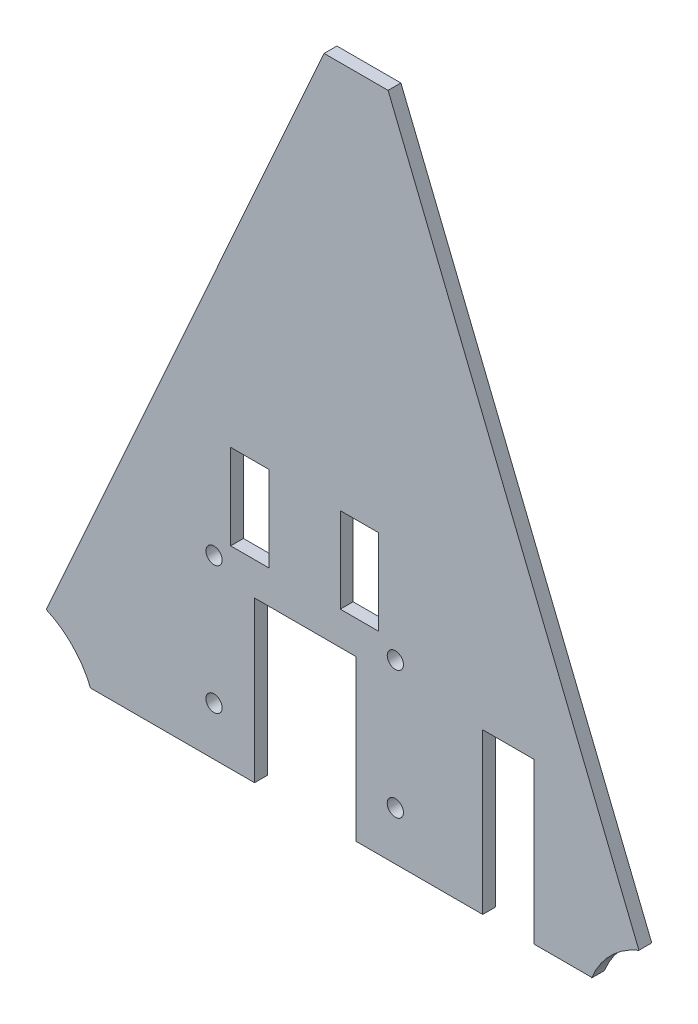
ISO-10303-21;
HEADER;
FILE_DESCRIPTION(('STEP AP214'),'2;1');
FILE_NAME('part.step','',(''),(''),'','','');
FILE_SCHEMA(('AUTOMOTIVE_DESIGN { 1 0 10303 214 1 1 1 1 }'));
ENDSEC;
DATA;
#1=APPLICATION_CONTEXT('core data for automotive mechanical design processes');
#2=APPLICATION_PROTOCOL_DEFINITION('international standard','automotive_design',2000,#1);
#3=PRODUCT_CONTEXT('',#1,'mechanical');
#4=PRODUCT('Part','Part','',(#3));
#5=PRODUCT_RELATED_PRODUCT_CATEGORY('part','',(#4));
#6=PRODUCT_DEFINITION_FORMATION('','',#4);
#7=PRODUCT_DEFINITION_CONTEXT('part definition',#1,'design');
#8=PRODUCT_DEFINITION('design','',#6,#7);
#9=PRODUCT_DEFINITION_SHAPE('','',#8);
#10=(LENGTH_UNIT() NAMED_UNIT(*) SI_UNIT(.MILLI.,.METRE.));
#11=(NAMED_UNIT(*) PLANE_ANGLE_UNIT() SI_UNIT($,.RADIAN.));
#12=(NAMED_UNIT(*) SI_UNIT($,.STERADIAN.) SOLID_ANGLE_UNIT());
#13=UNCERTAINTY_MEASURE_WITH_UNIT(LENGTH_MEASURE(1.E-05),#10,'distance_accuracy_value','');
#14=(GEOMETRIC_REPRESENTATION_CONTEXT(3) GLOBAL_UNCERTAINTY_ASSIGNED_CONTEXT((#13)) GLOBAL_UNIT_ASSIGNED_CONTEXT((#10,
#11,#12)) REPRESENTATION_CONTEXT('',''));
#15=CARTESIAN_POINT('',(0.,0.,0.));
#16=DIRECTION('',(0.,0.,1.));
#17=DIRECTION('',(1.,0.,0.));
#18=AXIS2_PLACEMENT_3D('',#15,#16,#17);
#19=CARTESIAN_POINT('',(0.,0.,0.));
#20=DIRECTION('',(0.,0.,1.));
#21=DIRECTION('',(1.,0.,0.));
#22=AXIS2_PLACEMENT_3D('',#19,#20,#21);
#23=PLANE('',#22);
#24=DIRECTION('',(-1.,0.,0.));
#25=VECTOR('',#24,1.);
#26=CARTESIAN_POINT('',(-157.234947473833,14.4657520615314,0.));
#27=LINE('',#26,#25);
#28=CARTESIAN_POINT('',(-157.234947473833,14.4657520615314,0.));
#29=VERTEX_POINT('',#28);
#30=CARTESIAN_POINT('',(-180.094947473833,14.4657520615314,0.));
#31=VERTEX_POINT('',#30);
#32=EDGE_CURVE('E418',#29,#31,#27,.T.);
#33=ORIENTED_EDGE('',*,*,#32,.T.);
#34=DIRECTION('',(0.,-1.,0.));
#35=VECTOR('',#34,1.);
#36=CARTESIAN_POINT('',(-180.094947473833,14.4657520615314,0.));
#37=LINE('',#36,#35);
#38=CARTESIAN_POINT('',(-180.094947473833,-36.3342479384686,0.));
#39=VERTEX_POINT('',#38);
#40=EDGE_CURVE('E415',#31,#39,#37,.T.);
#41=ORIENTED_EDGE('',*,*,#40,.T.);
#42=DIRECTION('',(-1.,0.,0.));
#43=VECTOR('',#42,1.);
#44=CARTESIAN_POINT('',(-157.234947473833,-36.3342479384686,0.));
#45=LINE('',#44,#43);
#46=CARTESIAN_POINT('',(-157.234947473833,-36.3342479384686,0.));
#47=VERTEX_POINT('',#46);
#48=EDGE_CURVE('E412',#47,#39,#45,.T.);
#49=ORIENTED_EDGE('',*,*,#48,.F.);
#50=DIRECTION('',(0.,-1.,0.));
#51=VECTOR('',#50,1.);
#52=CARTESIAN_POINT('',(-157.234947473833,14.4657520615314,0.));
#53=LINE('',#52,#51);
#54=EDGE_CURVE('E409',#29,#47,#53,.T.);
#55=ORIENTED_EDGE('',*,*,#54,.F.);
#56=EDGE_LOOP('',(#33,#41,#49,#55));
#57=FACE_BOUND('',#56,.T.);
#58=CARTESIAN_POINT('',(-255.278947473833,-46.2086142869327,0.));
#59=DIRECTION('',(0.,0.,-1.));
#60=DIRECTION('',(-1.,0.,0.));
#61=AXIS2_PLACEMENT_3D('',#58,#59,#60);
#62=CIRCLE('',#61,4.82599999999993);
#63=CARTESIAN_POINT('',(-260.104947473833,-46.2086142869327,0.));
#64=VERTEX_POINT('',#63);
#65=EDGE_CURVE('E227',#64,#64,#62,.T.);
#66=ORIENTED_EDGE('',*,*,#65,.F.);
#67=EDGE_LOOP('',(#66));
#68=FACE_BOUND('',#67,.T.);
#69=CARTESIAN_POINT('',(-147.328947473833,-46.2086142869327,0.));
#70=DIRECTION('',(0.,0.,-1.));
#71=DIRECTION('',(-1.,0.,0.));
#72=AXIS2_PLACEMENT_3D('',#69,#70,#71);
#73=CIRCLE('',#72,4.82599999999999);
#74=CARTESIAN_POINT('',(-152.154947473833,-46.2086142869327,0.));
#75=VERTEX_POINT('',#74);
#76=EDGE_CURVE('E432',#75,#75,#73,.T.);
#77=ORIENTED_EDGE('',*,*,#76,.F.);
#78=EDGE_LOOP('',(#77));
#79=FACE_BOUND('',#78,.T.);
#80=CARTESIAN_POINT('',(-147.328947473833,-122.408614286933,0.));
#81=DIRECTION('',(0.,0.,-1.));
#82=DIRECTION('',(-1.,0.,0.));
#83=AXIS2_PLACEMENT_3D('',#80,#81,#82);
#84=CIRCLE('',#83,4.82599999999999);
#85=CARTESIAN_POINT('',(-152.154947473833,-122.408614286933,0.));
#86=VERTEX_POINT('',#85);
#87=EDGE_CURVE('E261',#86,#86,#84,.T.);
#88=ORIENTED_EDGE('',*,*,#87,.F.);
#89=EDGE_LOOP('',(#88));
#90=FACE_BOUND('',#89,.T.);
#91=CARTESIAN_POINT('',(-255.278947473833,-122.408614286933,0.));
#92=DIRECTION('',(0.,0.,-1.));
#93=DIRECTION('',(-1.,0.,0.));
#94=AXIS2_PLACEMENT_3D('',#91,#92,#93);
#95=CIRCLE('',#94,4.82599999999993);
#96=CARTESIAN_POINT('',(-260.104947473833,-122.408614286933,0.));
#97=VERTEX_POINT('',#96);
#98=EDGE_CURVE('E267',#97,#97,#95,.T.);
#99=ORIENTED_EDGE('',*,*,#98,.F.);
#100=EDGE_LOOP('',(#99));
#101=FACE_BOUND('',#100,.T.);
#102=DIRECTION('',(-1.,0.,0.));
#103=VECTOR('',#102,1.);
#104=CARTESIAN_POINT('',(-222.512947473833,14.4657520615314,0.));
#105=LINE('',#104,#103);
#106=CARTESIAN_POINT('',(-222.512947473833,14.4657520615314,0.));
#107=VERTEX_POINT('',#106);
#108=CARTESIAN_POINT('',(-245.372947473833,14.4657520615314,0.));
#109=VERTEX_POINT('',#108);
#110=EDGE_CURVE('E376',#107,#109,#105,.T.);
#111=ORIENTED_EDGE('',*,*,#110,.T.);
#112=DIRECTION('',(0.,-1.,0.));
#113=VECTOR('',#112,1.);
#114=CARTESIAN_POINT('',(-245.372947473833,14.4657520615314,0.));
#115=LINE('',#114,#113);
#116=CARTESIAN_POINT('',(-245.372947473833,-36.3342479384686,0.));
#117=VERTEX_POINT('',#116);
#118=EDGE_CURVE('E379',#109,#117,#115,.T.);
#119=ORIENTED_EDGE('',*,*,#118,.T.);
#120=DIRECTION('',(-1.,0.,0.));
#121=VECTOR('',#120,1.);
#122=CARTESIAN_POINT('',(-222.512947473833,-36.3342479384686,0.));
#123=LINE('',#122,#121);
#124=CARTESIAN_POINT('',(-222.512947473833,-36.3342479384686,0.));
#125=VERTEX_POINT('',#124);
#126=EDGE_CURVE('E382',#125,#117,#123,.T.);
#127=ORIENTED_EDGE('',*,*,#126,.F.);
#128=DIRECTION('',(0.,-1.,0.));
#129=VECTOR('',#128,1.);
#130=CARTESIAN_POINT('',(-222.512947473833,14.4657520615314,0.));
#131=LINE('',#130,#129);
#132=EDGE_CURVE('E385',#107,#125,#131,.T.);
#133=ORIENTED_EDGE('',*,*,#132,.F.);
#134=EDGE_LOOP('',(#111,#119,#127,#133));
#135=FACE_BOUND('',#134,.T.);
#136=DIRECTION('',(-1.,0.,0.));
#137=VECTOR('',#136,1.);
#138=CARTESIAN_POINT('',(-218.448947473833,-56.1146142869327,0.));
#139=LINE('',#138,#137);
#140=CARTESIAN_POINT('',(-170.823947473833,-56.1146142869327,0.));
#141=VERTEX_POINT('',#140);
#142=CARTESIAN_POINT('',(-231.148947473833,-56.1146142869327,0.));
#143=VERTEX_POINT('',#142);
#144=EDGE_CURVE('E205',#141,#143,#139,.T.);
#145=ORIENTED_EDGE('',*,*,#144,.T.);
#146=DIRECTION('',(0.,1.,0.));
#147=VECTOR('',#146,1.);
#148=CARTESIAN_POINT('',(-231.148947473833,-151.364614286933,0.));
#149=LINE('',#148,#147);
#150=CARTESIAN_POINT('',(-231.148947473833,-151.364614286933,0.));
#151=VERTEX_POINT('',#150);
#152=EDGE_CURVE('E195',#151,#143,#149,.T.);
#153=ORIENTED_EDGE('',*,*,#152,.F.);
#154=DIRECTION('',(-1.,0.,0.));
#155=VECTOR('',#154,1.);
#156=CARTESIAN_POINT('',(-30.4451147456604,-151.364614286933,0.));
#157=LINE('',#156,#155);
#158=CARTESIAN_POINT('',(-328.815664837269,-151.364614286933,0.));
#159=VERTEX_POINT('',#158);
#160=EDGE_CURVE('E203',#151,#159,#157,.T.);
#161=ORIENTED_EDGE('',*,*,#160,.T.);
#162=CARTESIAN_POINT('',(-375.908525230326,-170.414614286933,0.));
#163=DIRECTION('',(0.,0.,-1.));
#164=DIRECTION('',(-1.,0.,0.));
#165=AXIS2_PLACEMENT_3D('',#162,#163,#164);
#166=CIRCLE('',#165,50.8);
#167=CARTESIAN_POINT('',(-355.149261179153,-124.049832867695,0.));
#168=VERTEX_POINT('',#167);
#169=EDGE_CURVE('E234',#168,#159,#166,.T.);
#170=ORIENTED_EDGE('',*,*,#169,.F.);
#171=DIRECTION('',(-0.408646930141206,-0.912692547622785,0.));
#172=VECTOR('',#171,1.);
#173=CARTESIAN_POINT('',(-189.740054038778,245.383385713067,0.));
#174=LINE('',#173,#172);
#175=CARTESIAN_POINT('',(-189.740054038778,245.383385713067,0.));
#176=VERTEX_POINT('',#175);
#177=EDGE_CURVE('E280',#176,#168,#174,.T.);
#178=ORIENTED_EDGE('',*,*,#177,.F.);
#179=DIRECTION('',(1.,0.,0.));
#180=VECTOR('',#179,1.);
#181=CARTESIAN_POINT('',(-189.740054038778,245.383385713067,0.));
#182=LINE('',#181,#180);
#183=CARTESIAN_POINT('',(-151.640054038778,245.383385713067,0.));
#184=VERTEX_POINT('',#183);
#185=EDGE_CURVE('E274',#176,#184,#182,.T.);
#186=ORIENTED_EDGE('',*,*,#185,.T.);
#187=DIRECTION('',(-0.375415571225287,0.926856595640119,0.));
#188=VECTOR('',#187,1.);
#189=CARTESIAN_POINT('',(16.7754747696738,-170.414614286933,0.));
#190=LINE('',#189,#188);
#191=CARTESIAN_POINT('',(-2.29563624857079,-123.330299228415,0.));
#192=VERTEX_POINT('',#191);
#193=EDGE_CURVE('E288',#192,#184,#190,.T.);
#194=ORIENTED_EDGE('',*,*,#193,.F.);
#195=CARTESIAN_POINT('',(16.7754747696738,-170.414614286933,0.));
#196=DIRECTION('',(0.,0.,-1.));
#197=DIRECTION('',(-1.,0.,0.));
#198=AXIS2_PLACEMENT_3D('',#195,#196,#197);
#199=CIRCLE('',#198,50.8);
#200=CARTESIAN_POINT('',(-30.4451147456604,-151.68346574168,0.));
#201=VERTEX_POINT('',#200);
#202=EDGE_CURVE('E243',#201,#192,#199,.T.);
#203=ORIENTED_EDGE('',*,*,#202,.F.);
#204=DIRECTION('',(0.,1.,0.));
#205=VECTOR('',#204,1.);
#206=CARTESIAN_POINT('',(-30.4451147456604,-170.414614286933,0.));
#207=LINE('',#206,#205);
#208=CARTESIAN_POINT('',(-30.4451147456604,-151.364614286933,0.));
#209=VERTEX_POINT('',#208);
#210=EDGE_CURVE('E324',#201,#209,#207,.T.);
#211=ORIENTED_EDGE('',*,*,#210,.T.);
#212=DIRECTION('',(-1.,0.,0.));
#213=VECTOR('',#212,1.);
#214=CARTESIAN_POINT('',(-30.4451147456604,-151.364614286933,0.));
#215=LINE('',#214,#213);
#216=CARTESIAN_POINT('',(-64.8262570465055,-151.364614286933,0.));
#217=VERTEX_POINT('',#216);
#218=EDGE_CURVE('E327',#209,#217,#215,.T.);
#219=ORIENTED_EDGE('',*,*,#218,.T.);
#220=DIRECTION('',(0.,1.,0.));
#221=VECTOR('',#220,1.);
#222=CARTESIAN_POINT('',(-64.8262570465055,-170.414614286933,0.));
#223=LINE('',#222,#221);
#224=CARTESIAN_POINT('',(-64.8262570465055,-56.1146142869327,0.));
#225=VERTEX_POINT('',#224);
#226=EDGE_CURVE('E247',#217,#225,#223,.T.);
#227=ORIENTED_EDGE('',*,*,#226,.T.);
#228=DIRECTION('',(-1.,0.,0.));
#229=VECTOR('',#228,1.);
#230=CARTESIAN_POINT('',(-64.8262570465055,-56.1146142869327,0.));
#231=LINE('',#230,#229);
#232=CARTESIAN_POINT('',(-95.3062570465055,-56.1146142869327,0.));
#233=VERTEX_POINT('',#232);
#234=EDGE_CURVE('E249',#225,#233,#231,.T.);
#235=ORIENTED_EDGE('',*,*,#234,.T.);
#236=DIRECTION('',(0.,-1.,0.));
#237=VECTOR('',#236,1.);
#238=CARTESIAN_POINT('',(-95.3062570465055,-56.1146142869327,0.));
#239=LINE('',#238,#237);
#240=CARTESIAN_POINT('',(-95.3062570465055,-151.364614286933,0.));
#241=VERTEX_POINT('',#240);
#242=EDGE_CURVE('E252',#233,#241,#239,.T.);
#243=ORIENTED_EDGE('',*,*,#242,.T.);
#244=DIRECTION('',(-1.,0.,0.));
#245=VECTOR('',#244,1.);
#246=CARTESIAN_POINT('',(-30.4451147456604,-151.364614286933,0.));
#247=LINE('',#246,#245);
#248=CARTESIAN_POINT('',(-170.823947473833,-151.364614286933,0.));
#249=VERTEX_POINT('',#248);
#250=EDGE_CURVE('E223',#241,#249,#247,.T.);
#251=ORIENTED_EDGE('',*,*,#250,.T.);
#252=DIRECTION('',(0.,1.,0.));
#253=VECTOR('',#252,1.);
#254=CARTESIAN_POINT('',(-170.823947473833,-151.364614286933,0.));
#255=LINE('',#254,#253);
#256=EDGE_CURVE('E60',#249,#141,#255,.T.);
#257=ORIENTED_EDGE('',*,*,#256,.T.);
#258=EDGE_LOOP('',(#145,#153,#161,#170,#178,#186,#194,#203,#211,#219,#227,#235,#243,#251,#257));
#259=FACE_BOUND('',#258,.T.);
#260=ADVANCED_FACE('F37',(#57,#68,#79,#90,#101,#135,#259),#23,.F.);
#261=CARTESIAN_POINT('',(0.,0.,7.62));
#262=DIRECTION('',(0.,0.,1.));
#263=DIRECTION('',(1.,0.,0.));
#264=AXIS2_PLACEMENT_3D('',#261,#262,#263);
#265=PLANE('',#264);
#266=CARTESIAN_POINT('',(-255.278947473833,-46.2086142869327,7.62));
#267=DIRECTION('',(0.,0.,1.));
#268=DIRECTION('',(1.,0.,0.));
#269=AXIS2_PLACEMENT_3D('',#266,#267,#268);
#270=CIRCLE('',#269,4.82599999999993);
#271=CARTESIAN_POINT('',(-250.452947473833,-46.2086142869327,7.62));
#272=VERTEX_POINT('',#271);
#273=EDGE_CURVE('E429',#272,#272,#270,.F.);
#274=ORIENTED_EDGE('',*,*,#273,.T.);
#275=EDGE_LOOP('',(#274));
#276=FACE_BOUND('',#275,.T.);
#277=CARTESIAN_POINT('',(-147.328947473833,-46.2086142869327,7.62));
#278=DIRECTION('',(0.,0.,1.));
#279=DIRECTION('',(1.,0.,0.));
#280=AXIS2_PLACEMENT_3D('',#277,#278,#279);
#281=CIRCLE('',#280,4.82599999999999);
#282=CARTESIAN_POINT('',(-142.502947473833,-46.2086142869327,7.62));
#283=VERTEX_POINT('',#282);
#284=EDGE_CURVE('E399',#283,#283,#281,.F.);
#285=ORIENTED_EDGE('',*,*,#284,.T.);
#286=EDGE_LOOP('',(#285));
#287=FACE_BOUND('',#286,.T.);
#288=CARTESIAN_POINT('',(-147.328947473833,-122.408614286933,7.62));
#289=DIRECTION('',(0.,0.,1.));
#290=DIRECTION('',(1.,0.,0.));
#291=AXIS2_PLACEMENT_3D('',#288,#289,#290);
#292=CIRCLE('',#291,4.82599999999999);
#293=CARTESIAN_POINT('',(-142.502947473833,-122.408614286933,7.62));
#294=VERTEX_POINT('',#293);
#295=EDGE_CURVE('E264',#294,#294,#292,.F.);
#296=ORIENTED_EDGE('',*,*,#295,.T.);
#297=EDGE_LOOP('',(#296));
#298=FACE_BOUND('',#297,.T.);
#299=CARTESIAN_POINT('',(-255.278947473833,-122.408614286933,7.62));
#300=DIRECTION('',(0.,0.,1.));
#301=DIRECTION('',(1.,0.,0.));
#302=AXIS2_PLACEMENT_3D('',#299,#300,#301);
#303=CIRCLE('',#302,4.82599999999993);
#304=CARTESIAN_POINT('',(-250.452947473833,-122.408614286933,7.62));
#305=VERTEX_POINT('',#304);
#306=EDGE_CURVE('E260',#305,#305,#303,.F.);
#307=ORIENTED_EDGE('',*,*,#306,.T.);
#308=EDGE_LOOP('',(#307));
#309=FACE_BOUND('',#308,.T.);
#310=DIRECTION('',(0.,-1.,0.));
#311=VECTOR('',#310,1.);
#312=CARTESIAN_POINT('',(-180.094947473833,14.4657520615314,7.62));
#313=LINE('',#312,#311);
#314=CARTESIAN_POINT('',(-180.094947473833,14.4657520615314,7.62));
#315=VERTEX_POINT('',#314);
#316=CARTESIAN_POINT('',(-180.094947473833,-36.3342479384686,7.62));
#317=VERTEX_POINT('',#316);
#318=EDGE_CURVE('E423',#315,#317,#313,.T.);
#319=ORIENTED_EDGE('',*,*,#318,.F.);
#320=DIRECTION('',(-1.,0.,0.));
#321=VECTOR('',#320,1.);
#322=CARTESIAN_POINT('',(-157.234947473833,14.4657520615314,7.62));
#323=LINE('',#322,#321);
#324=CARTESIAN_POINT('',(-157.234947473833,14.4657520615314,7.62));
#325=VERTEX_POINT('',#324);
#326=EDGE_CURVE('E421',#325,#315,#323,.T.);
#327=ORIENTED_EDGE('',*,*,#326,.F.);
#328=DIRECTION('',(0.,-1.,0.));
#329=VECTOR('',#328,1.);
#330=CARTESIAN_POINT('',(-157.234947473833,14.4657520615314,7.62));
#331=LINE('',#330,#329);
#332=CARTESIAN_POINT('',(-157.234947473833,-36.3342479384686,7.62));
#333=VERTEX_POINT('',#332);
#334=EDGE_CURVE('E355',#325,#333,#331,.T.);
#335=ORIENTED_EDGE('',*,*,#334,.T.);
#336=DIRECTION('',(-1.,0.,0.));
#337=VECTOR('',#336,1.);
#338=CARTESIAN_POINT('',(-157.234947473833,-36.3342479384686,7.62));
#339=LINE('',#338,#337);
#340=EDGE_CURVE('E372',#333,#317,#339,.T.);
#341=ORIENTED_EDGE('',*,*,#340,.T.);
#342=EDGE_LOOP('',(#319,#327,#335,#341));
#343=FACE_BOUND('',#342,.T.);
#344=DIRECTION('',(0.,-1.,0.));
#345=VECTOR('',#344,1.);
#346=CARTESIAN_POINT('',(-245.372947473833,14.4657520615314,7.62));
#347=LINE('',#346,#345);
#348=CARTESIAN_POINT('',(-245.372947473833,14.4657520615314,7.62));
#349=VERTEX_POINT('',#348);
#350=CARTESIAN_POINT('',(-245.372947473833,-36.3342479384686,7.62));
#351=VERTEX_POINT('',#350);
#352=EDGE_CURVE('E371',#349,#351,#347,.T.);
#353=ORIENTED_EDGE('',*,*,#352,.F.);
#354=DIRECTION('',(-1.,0.,0.));
#355=VECTOR('',#354,1.);
#356=CARTESIAN_POINT('',(-222.512947473833,14.4657520615314,7.62));
#357=LINE('',#356,#355);
#358=CARTESIAN_POINT('',(-222.512947473833,14.4657520615314,7.62));
#359=VERTEX_POINT('',#358);
#360=EDGE_CURVE('E374',#359,#349,#357,.T.);
#361=ORIENTED_EDGE('',*,*,#360,.F.);
#362=DIRECTION('',(0.,-1.,0.));
#363=VECTOR('',#362,1.);
#364=CARTESIAN_POINT('',(-222.512947473833,14.4657520615314,7.62));
#365=LINE('',#364,#363);
#366=CARTESIAN_POINT('',(-222.512947473833,-36.3342479384686,7.62));
#367=VERTEX_POINT('',#366);
#368=EDGE_CURVE('E397',#359,#367,#365,.T.);
#369=ORIENTED_EDGE('',*,*,#368,.T.);
#370=DIRECTION('',(-1.,0.,0.));
#371=VECTOR('',#370,1.);
#372=CARTESIAN_POINT('',(-222.512947473833,-36.3342479384686,7.62));
#373=LINE('',#372,#371);
#374=EDGE_CURVE('E368',#367,#351,#373,.T.);
#375=ORIENTED_EDGE('',*,*,#374,.T.);
#376=EDGE_LOOP('',(#353,#361,#369,#375));
#377=FACE_BOUND('',#376,.T.);
#378=DIRECTION('',(0.,1.,0.));
#379=VECTOR('',#378,1.);
#380=CARTESIAN_POINT('',(-231.148947473833,-151.364614286933,7.62));
#381=LINE('',#380,#379);
#382=CARTESIAN_POINT('',(-231.148947473833,-151.364614286933,7.62));
#383=VERTEX_POINT('',#382);
#384=CARTESIAN_POINT('',(-231.148947473833,-56.1146142869327,7.62));
#385=VERTEX_POINT('',#384);
#386=EDGE_CURVE('E52',#383,#385,#381,.T.);
#387=ORIENTED_EDGE('',*,*,#386,.T.);
#388=DIRECTION('',(-1.,0.,0.));
#389=VECTOR('',#388,1.);
#390=CARTESIAN_POINT('',(-218.448947473833,-56.1146142869327,7.61999999999996));
#391=LINE('',#390,#389);
#392=CARTESIAN_POINT('',(-170.823947473833,-56.1146142869327,7.62));
#393=VERTEX_POINT('',#392);
#394=EDGE_CURVE('E272',#393,#385,#391,.T.);
#395=ORIENTED_EDGE('',*,*,#394,.F.);
#396=DIRECTION('',(0.,1.,0.));
#397=VECTOR('',#396,1.);
#398=CARTESIAN_POINT('',(-170.823947473833,-151.364614286933,7.62));
#399=LINE('',#398,#397);
#400=CARTESIAN_POINT('',(-170.823947473833,-151.364614286933,7.62));
#401=VERTEX_POINT('',#400);
#402=EDGE_CURVE('E207',#401,#393,#399,.T.);
#403=ORIENTED_EDGE('',*,*,#402,.F.);
#404=DIRECTION('',(-1.,0.,0.));
#405=VECTOR('',#404,1.);
#406=CARTESIAN_POINT('',(-30.4451147456604,-151.364614286933,7.62));
#407=LINE('',#406,#405);
#408=CARTESIAN_POINT('',(-95.3062570465055,-151.364614286933,7.62));
#409=VERTEX_POINT('',#408);
#410=EDGE_CURVE('E228',#409,#401,#407,.T.);
#411=ORIENTED_EDGE('',*,*,#410,.F.);
#412=DIRECTION('',(0.,1.,0.));
#413=VECTOR('',#412,1.);
#414=CARTESIAN_POINT('',(-95.3062570465055,0.,7.62));
#415=LINE('',#414,#413);
#416=CARTESIAN_POINT('',(-95.3062570465055,-56.1146142869327,7.62));
#417=VERTEX_POINT('',#416);
#418=EDGE_CURVE('E294',#409,#417,#415,.T.);
#419=ORIENTED_EDGE('',*,*,#418,.T.);
#420=DIRECTION('',(1.,0.,0.));
#421=VECTOR('',#420,1.);
#422=CARTESIAN_POINT('',(0.,-56.1146142869327,7.62));
#423=LINE('',#422,#421);
#424=CARTESIAN_POINT('',(-64.8262570465055,-56.1146142869327,7.62));
#425=VERTEX_POINT('',#424);
#426=EDGE_CURVE('E45',#417,#425,#423,.T.);
#427=ORIENTED_EDGE('',*,*,#426,.T.);
#428=DIRECTION('',(0.,-1.,0.));
#429=VECTOR('',#428,1.);
#430=CARTESIAN_POINT('',(-64.8262570465055,0.,7.62));
#431=LINE('',#430,#429);
#432=CARTESIAN_POINT('',(-64.8262570465055,-151.364614286933,7.62));
#433=VERTEX_POINT('',#432);
#434=EDGE_CURVE('E11',#425,#433,#431,.T.);
#435=ORIENTED_EDGE('',*,*,#434,.T.);
#436=DIRECTION('',(-1.,0.,0.));
#437=VECTOR('',#436,1.);
#438=CARTESIAN_POINT('',(-30.4451147456604,-151.364614286933,7.62));
#439=LINE('',#438,#437);
#440=CARTESIAN_POINT('',(-30.4451147456604,-151.364614286933,7.62));
#441=VERTEX_POINT('',#440);
#442=EDGE_CURVE('E317',#441,#433,#439,.T.);
#443=ORIENTED_EDGE('',*,*,#442,.F.);
#444=DIRECTION('',(0.,1.,0.));
#445=VECTOR('',#444,1.);
#446=CARTESIAN_POINT('',(-30.4451147456604,-170.414614286933,7.62));
#447=LINE('',#446,#445);
#448=CARTESIAN_POINT('',(-30.4451147456604,-151.68346574168,7.62));
#449=VERTEX_POINT('',#448);
#450=EDGE_CURVE('E319',#449,#441,#447,.T.);
#451=ORIENTED_EDGE('',*,*,#450,.F.);
#452=CARTESIAN_POINT('',(16.7754747696738,-170.414614286933,7.62));
#453=DIRECTION('',(0.,0.,1.));
#454=DIRECTION('',(1.,0.,0.));
#455=AXIS2_PLACEMENT_3D('',#452,#453,#454);
#456=CIRCLE('',#455,50.8);
#457=CARTESIAN_POINT('',(-2.29563624857079,-123.330299228415,7.62));
#458=VERTEX_POINT('',#457);
#459=EDGE_CURVE('E245',#449,#458,#456,.F.);
#460=ORIENTED_EDGE('',*,*,#459,.T.);
#461=DIRECTION('',(-0.375415571225287,0.926856595640119,0.));
#462=VECTOR('',#461,1.);
#463=CARTESIAN_POINT('',(16.7754747696738,-170.414614286933,7.62));
#464=LINE('',#463,#462);
#465=CARTESIAN_POINT('',(-151.640054038778,245.383385713067,7.62));
#466=VERTEX_POINT('',#465);
#467=EDGE_CURVE('E279',#458,#466,#464,.T.);
#468=ORIENTED_EDGE('',*,*,#467,.T.);
#469=DIRECTION('',(1.,0.,0.));
#470=VECTOR('',#469,1.);
#471=CARTESIAN_POINT('',(-189.740054038778,245.383385713067,7.62));
#472=LINE('',#471,#470);
#473=CARTESIAN_POINT('',(-189.740054038778,245.383385713067,7.62));
#474=VERTEX_POINT('',#473);
#475=EDGE_CURVE('E276',#474,#466,#472,.T.);
#476=ORIENTED_EDGE('',*,*,#475,.F.);
#477=DIRECTION('',(-0.408646930141206,-0.912692547622785,0.));
#478=VECTOR('',#477,1.);
#479=CARTESIAN_POINT('',(-189.740054038778,245.383385713067,7.62));
#480=LINE('',#479,#478);
#481=CARTESIAN_POINT('',(-355.149261179153,-124.049832867695,7.62));
#482=VERTEX_POINT('',#481);
#483=EDGE_CURVE('E282',#474,#482,#480,.T.);
#484=ORIENTED_EDGE('',*,*,#483,.T.);
#485=CARTESIAN_POINT('',(-375.908525230326,-170.414614286933,7.62));
#486=DIRECTION('',(0.,0.,1.));
#487=DIRECTION('',(1.,0.,0.));
#488=AXIS2_PLACEMENT_3D('',#485,#486,#487);
#489=CIRCLE('',#488,50.8);
#490=CARTESIAN_POINT('',(-328.815664837269,-151.364614286933,7.62));
#491=VERTEX_POINT('',#490);
#492=EDGE_CURVE('E237',#482,#491,#489,.F.);
#493=ORIENTED_EDGE('',*,*,#492,.T.);
#494=DIRECTION('',(-1.,0.,0.));
#495=VECTOR('',#494,1.);
#496=CARTESIAN_POINT('',(-30.4451147456604,-151.364614286933,7.62));
#497=LINE('',#496,#495);
#498=EDGE_CURVE('E218',#383,#491,#497,.T.);
#499=ORIENTED_EDGE('',*,*,#498,.F.);
#500=EDGE_LOOP('',(#387,#395,#403,#411,#419,#427,#435,#443,#451,#460,#468,#476,#484,#493,#499));
#501=FACE_BOUND('',#500,.T.);
#502=ADVANCED_FACE('F300',(#276,#287,#298,#309,#343,#377,#501),#265,.T.);
#503=CARTESIAN_POINT('',(-30.4451147456604,-151.364614286933,7.621));
#504=DIRECTION('',(0.,-1.,0.));
#505=DIRECTION('',(0.,0.,-1.));
#506=AXIS2_PLACEMENT_3D('',#503,#504,#505);
#507=PLANE('',#506);
#508=ORIENTED_EDGE('',*,*,#410,.T.);
#509=DIRECTION('',(0.,0.,-1.));
#510=VECTOR('',#509,1.);
#511=CARTESIAN_POINT('',(-170.823947473833,-151.364614286933,7.621));
#512=LINE('',#511,#510);
#513=EDGE_CURVE('E362',#401,#249,#512,.T.);
#514=ORIENTED_EDGE('',*,*,#513,.T.);
#515=ORIENTED_EDGE('',*,*,#250,.F.);
#516=DIRECTION('',(0.,0.,1.));
#517=VECTOR('',#516,1.);
#518=CARTESIAN_POINT('',(-95.3062570465055,-151.364614286933,7.621));
#519=LINE('',#518,#517);
#520=EDGE_CURVE('E226',#241,#409,#519,.T.);
#521=ORIENTED_EDGE('',*,*,#520,.T.);
#522=EDGE_LOOP('',(#508,#514,#515,#521));
#523=FACE_BOUND('',#522,.T.);
#524=ADVANCED_FACE('F510',(#523),#507,.T.);
#525=CARTESIAN_POINT('',(-64.8262570465055,-170.414614286933,25.4));
#526=DIRECTION('',(-1.,0.,0.));
#527=DIRECTION('',(0.,-1.,0.));
#528=AXIS2_PLACEMENT_3D('',#525,#526,#527);
#529=PLANE('',#528);
#530=ORIENTED_EDGE('',*,*,#226,.F.);
#531=DIRECTION('',(0.,0.,-1.));
#532=VECTOR('',#531,1.);
#533=CARTESIAN_POINT('',(-64.8262570465055,-151.364614286933,7.621));
#534=LINE('',#533,#532);
#535=EDGE_CURVE('E216',#433,#217,#534,.T.);
#536=ORIENTED_EDGE('',*,*,#535,.F.);
#537=ORIENTED_EDGE('',*,*,#434,.F.);
#538=DIRECTION('',(0.,0.,-1.));
#539=VECTOR('',#538,1.);
#540=CARTESIAN_POINT('',(-64.8262570465055,-56.1146142869327,25.4));
#541=LINE('',#540,#539);
#542=EDGE_CURVE('E257',#425,#225,#541,.T.);
#543=ORIENTED_EDGE('',*,*,#542,.T.);
#544=EDGE_LOOP('',(#530,#536,#537,#543));
#545=FACE_BOUND('',#544,.T.);
#546=ADVANCED_FACE('F312',(#545),#529,.T.);
#547=CARTESIAN_POINT('',(-95.3062570465055,-56.1146142869327,25.4));
#548=DIRECTION('',(1.,0.,0.));
#549=DIRECTION('',(0.,0.,-1.));
#550=AXIS2_PLACEMENT_3D('',#547,#548,#549);
#551=PLANE('',#550);
#552=ORIENTED_EDGE('',*,*,#418,.F.);
#553=ORIENTED_EDGE('',*,*,#520,.F.);
#554=ORIENTED_EDGE('',*,*,#242,.F.);
#555=DIRECTION('',(0.,0.,-1.));
#556=VECTOR('',#555,1.);
#557=CARTESIAN_POINT('',(-95.3062570465055,-56.1146142869327,25.4));
#558=LINE('',#557,#556);
#559=EDGE_CURVE('E255',#417,#233,#558,.T.);
#560=ORIENTED_EDGE('',*,*,#559,.F.);
#561=EDGE_LOOP('',(#552,#553,#554,#560));
#562=FACE_BOUND('',#561,.T.);
#563=ADVANCED_FACE('F518',(#562),#551,.T.);
#564=CARTESIAN_POINT('',(16.7754747696738,-170.414614286933,7.621));
#565=DIRECTION('',(0.,0.,-1.));
#566=DIRECTION('',(-1.,0.,0.));
#567=AXIS2_PLACEMENT_3D('',#564,#565,#566);
#568=CYLINDRICAL_SURFACE('',#567,50.8);
#569=DIRECTION('',(0.,0.,-1.));
#570=VECTOR('',#569,1.);
#571=CARTESIAN_POINT('',(-30.4451147456604,-151.68346574168,7.621));
#572=LINE('',#571,#570);
#573=EDGE_CURVE('E213',#449,#201,#572,.T.);
#574=ORIENTED_EDGE('',*,*,#573,.T.);
#575=ORIENTED_EDGE('',*,*,#202,.T.);
#576=DIRECTION('',(0.,0.,-1.));
#577=VECTOR('',#576,1.);
#578=CARTESIAN_POINT('',(-2.29563624857079,-123.330299228415,7.621));
#579=LINE('',#578,#577);
#580=EDGE_CURVE('E240',#192,#458,#579,.F.);
#581=ORIENTED_EDGE('',*,*,#580,.T.);
#582=ORIENTED_EDGE('',*,*,#459,.F.);
#583=EDGE_LOOP('',(#574,#575,#581,#582));
#584=FACE_BOUND('',#583,.T.);
#585=ADVANCED_FACE('F337',(#584),#568,.F.);
#586=CARTESIAN_POINT('',(-375.908525230326,-170.414614286933,7.621));
#587=DIRECTION('',(0.,0.,-1.));
#588=DIRECTION('',(-1.,0.,0.));
#589=AXIS2_PLACEMENT_3D('',#586,#587,#588);
#590=CYLINDRICAL_SURFACE('',#589,50.8);
#591=DIRECTION('',(0.,0.,-1.));
#592=VECTOR('',#591,1.);
#593=CARTESIAN_POINT('',(-328.815664837269,-151.364614286933,7.621));
#594=LINE('',#593,#592);
#595=EDGE_CURVE('E211',#159,#491,#594,.F.);
#596=ORIENTED_EDGE('',*,*,#595,.T.);
#597=ORIENTED_EDGE('',*,*,#492,.F.);
#598=DIRECTION('',(0.,0.,-1.));
#599=VECTOR('',#598,1.);
#600=CARTESIAN_POINT('',(-355.149261179153,-124.049832867695,7.621));
#601=LINE('',#600,#599);
#602=EDGE_CURVE('E232',#482,#168,#601,.T.);
#603=ORIENTED_EDGE('',*,*,#602,.T.);
#604=ORIENTED_EDGE('',*,*,#169,.T.);
#605=EDGE_LOOP('',(#596,#597,#603,#604));
#606=FACE_BOUND('',#605,.T.);
#607=ADVANCED_FACE('F352',(#606),#590,.F.);
#608=CARTESIAN_POINT('',(-189.740054038778,245.383385713067,7.62));
#609=DIRECTION('',(0.,1.,0.));
#610=DIRECTION('',(0.,0.,1.));
#611=AXIS2_PLACEMENT_3D('',#608,#609,#610);
#612=PLANE('',#611);
#613=ORIENTED_EDGE('',*,*,#185,.F.);
#614=DIRECTION('',(0.,0.,-1.));
#615=VECTOR('',#614,1.);
#616=CARTESIAN_POINT('',(-189.740054038778,245.383385713067,7.62));
#617=LINE('',#616,#615);
#618=EDGE_CURVE('E292',#474,#176,#617,.T.);
#619=ORIENTED_EDGE('',*,*,#618,.F.);
#620=ORIENTED_EDGE('',*,*,#475,.T.);
#621=DIRECTION('',(0.,0.,-1.));
#622=VECTOR('',#621,1.);
#623=CARTESIAN_POINT('',(-151.640054038778,245.383385713067,7.62));
#624=LINE('',#623,#622);
#625=EDGE_CURVE('E285',#466,#184,#624,.T.);
#626=ORIENTED_EDGE('',*,*,#625,.T.);
#627=EDGE_LOOP('',(#613,#619,#620,#626));
#628=FACE_BOUND('',#627,.T.);
#629=ADVANCED_FACE('F39',(#628),#612,.T.);
#630=CARTESIAN_POINT('',(-189.740054038778,245.383385713067,7.62));
#631=DIRECTION('',(0.912692547622784,-0.408646930141206,0.));
#632=DIRECTION('',(0.408646930141206,0.912692547622785,0.));
#633=AXIS2_PLACEMENT_3D('',#630,#631,#632);
#634=PLANE('',#633);
#635=ORIENTED_EDGE('',*,*,#177,.T.);
#636=ORIENTED_EDGE('',*,*,#602,.F.);
#637=ORIENTED_EDGE('',*,*,#483,.F.);
#638=ORIENTED_EDGE('',*,*,#618,.T.);
#639=EDGE_LOOP('',(#635,#636,#637,#638));
#640=FACE_BOUND('',#639,.T.);
#641=ADVANCED_FACE('F350',(#640),#634,.F.);
#642=CARTESIAN_POINT('',(16.7754747696738,-170.414614286933,7.62));
#643=DIRECTION('',(-0.926856595640119,-0.375415571225287,0.));
#644=DIRECTION('',(0.375415571225287,-0.926856595640119,0.));
#645=AXIS2_PLACEMENT_3D('',#642,#643,#644);
#646=PLANE('',#645);
#647=ORIENTED_EDGE('',*,*,#467,.F.);
#648=ORIENTED_EDGE('',*,*,#580,.F.);
#649=ORIENTED_EDGE('',*,*,#193,.T.);
#650=ORIENTED_EDGE('',*,*,#625,.F.);
#651=EDGE_LOOP('',(#647,#648,#649,#650));
#652=FACE_BOUND('',#651,.T.);
#653=ADVANCED_FACE('F341',(#652),#646,.F.);
#654=CARTESIAN_POINT('',(-218.448947473833,-56.1146142869327,-704.368315515871));
#655=DIRECTION('',(0.,-1.,0.));
#656=DIRECTION('',(0.,0.,-1.));
#657=AXIS2_PLACEMENT_3D('',#654,#655,#656);
#658=PLANE('',#657);
#659=ORIENTED_EDGE('',*,*,#144,.F.);
#660=DIRECTION('',(0.,0.,-1.));
#661=VECTOR('',#660,1.);
#662=CARTESIAN_POINT('',(-170.823947473833,-56.1146142869327,7.621));
#663=LINE('',#662,#661);
#664=EDGE_CURVE('E364',#393,#141,#663,.T.);
#665=ORIENTED_EDGE('',*,*,#664,.F.);
#666=ORIENTED_EDGE('',*,*,#394,.T.);
#667=DIRECTION('',(0.,0.,-1.));
#668=VECTOR('',#667,1.);
#669=CARTESIAN_POINT('',(-231.148947473833,-56.1146142869327,7.621));
#670=LINE('',#669,#668);
#671=EDGE_CURVE('E199',#385,#143,#670,.T.);
#672=ORIENTED_EDGE('',*,*,#671,.T.);
#673=EDGE_LOOP('',(#659,#665,#666,#672));
#674=FACE_BOUND('',#673,.T.);
#675=ADVANCED_FACE('F533',(#674),#658,.T.);
#676=CARTESIAN_POINT('',(-255.278947473833,-122.408614286933,7.621));
#677=DIRECTION('',(0.,0.,-1.));
#678=DIRECTION('',(-1.,0.,0.));
#679=AXIS2_PLACEMENT_3D('',#676,#677,#678);
#680=CYLINDRICAL_SURFACE('',#679,4.82599999999993);
#681=ORIENTED_EDGE('',*,*,#306,.F.);
#682=EDGE_LOOP('',(#681));
#683=FACE_BOUND('',#682,.T.);
#684=ORIENTED_EDGE('',*,*,#98,.T.);
#685=EDGE_LOOP('',(#684));
#686=FACE_BOUND('',#685,.T.);
#687=ADVANCED_FACE('F529',(#683,#686),#680,.F.);
#688=CARTESIAN_POINT('',(-147.328947473833,-122.408614286933,7.621));
#689=DIRECTION('',(0.,0.,-1.));
#690=DIRECTION('',(-1.,0.,0.));
#691=AXIS2_PLACEMENT_3D('',#688,#689,#690);
#692=CYLINDRICAL_SURFACE('',#691,4.82599999999999);
#693=ORIENTED_EDGE('',*,*,#295,.F.);
#694=EDGE_LOOP('',(#693));
#695=FACE_BOUND('',#694,.T.);
#696=ORIENTED_EDGE('',*,*,#87,.T.);
#697=EDGE_LOOP('',(#696));
#698=FACE_BOUND('',#697,.T.);
#699=ADVANCED_FACE('F524',(#695,#698),#692,.F.);
#700=CARTESIAN_POINT('',(-64.8262570465055,-56.1146142869327,25.4));
#701=DIRECTION('',(0.,-1.,0.));
#702=DIRECTION('',(0.,0.,-1.));
#703=AXIS2_PLACEMENT_3D('',#700,#701,#702);
#704=PLANE('',#703);
#705=ORIENTED_EDGE('',*,*,#559,.T.);
#706=ORIENTED_EDGE('',*,*,#234,.F.);
#707=ORIENTED_EDGE('',*,*,#542,.F.);
#708=ORIENTED_EDGE('',*,*,#426,.F.);
#709=EDGE_LOOP('',(#705,#706,#707,#708));
#710=FACE_BOUND('',#709,.T.);
#711=ADVANCED_FACE('F307',(#710),#704,.T.);
#712=CARTESIAN_POINT('',(-30.4451147456604,-151.364614286933,7.621));
#713=DIRECTION('',(0.,-1.,0.));
#714=DIRECTION('',(0.,0.,-1.));
#715=AXIS2_PLACEMENT_3D('',#712,#713,#714);
#716=PLANE('',#715);
#717=DIRECTION('',(0.,0.,-1.));
#718=VECTOR('',#717,1.);
#719=CARTESIAN_POINT('',(-231.148947473833,-151.364614286933,7.621));
#720=LINE('',#719,#718);
#721=EDGE_CURVE('E192',#383,#151,#720,.T.);
#722=ORIENTED_EDGE('',*,*,#721,.F.);
#723=ORIENTED_EDGE('',*,*,#498,.T.);
#724=ORIENTED_EDGE('',*,*,#595,.F.);
#725=ORIENTED_EDGE('',*,*,#160,.F.);
#726=EDGE_LOOP('',(#722,#723,#724,#725));
#727=FACE_BOUND('',#726,.T.);
#728=ADVANCED_FACE('F209',(#727),#716,.T.);
#729=CARTESIAN_POINT('',(-30.4451147456604,-151.364614286933,7.621));
#730=DIRECTION('',(0.,-1.,0.));
#731=DIRECTION('',(0.,0.,-1.));
#732=AXIS2_PLACEMENT_3D('',#729,#730,#731);
#733=PLANE('',#732);
#734=ORIENTED_EDGE('',*,*,#442,.T.);
#735=ORIENTED_EDGE('',*,*,#535,.T.);
#736=ORIENTED_EDGE('',*,*,#218,.F.);
#737=DIRECTION('',(0.,0.,-1.));
#738=VECTOR('',#737,1.);
#739=CARTESIAN_POINT('',(-30.4451147456604,-151.364614286933,7.621));
#740=LINE('',#739,#738);
#741=EDGE_CURVE('E235',#441,#209,#740,.T.);
#742=ORIENTED_EDGE('',*,*,#741,.F.);
#743=EDGE_LOOP('',(#734,#735,#736,#742));
#744=FACE_BOUND('',#743,.T.);
#745=ADVANCED_FACE('F332',(#744),#733,.T.);
#746=CARTESIAN_POINT('',(-30.4451147456604,-170.414614286933,7.621));
#747=DIRECTION('',(-1.,0.,0.));
#748=DIRECTION('',(0.,0.,1.));
#749=AXIS2_PLACEMENT_3D('',#746,#747,#748);
#750=PLANE('',#749);
#751=ORIENTED_EDGE('',*,*,#450,.T.);
#752=ORIENTED_EDGE('',*,*,#741,.T.);
#753=ORIENTED_EDGE('',*,*,#210,.F.);
#754=ORIENTED_EDGE('',*,*,#573,.F.);
#755=EDGE_LOOP('',(#751,#752,#753,#754));
#756=FACE_BOUND('',#755,.T.);
#757=ADVANCED_FACE('F330',(#756),#750,.T.);
#758=CARTESIAN_POINT('',(-147.328947473833,-46.2086142869327,7.621));
#759=DIRECTION('',(0.,0.,-1.));
#760=DIRECTION('',(-1.,0.,0.));
#761=AXIS2_PLACEMENT_3D('',#758,#759,#760);
#762=CYLINDRICAL_SURFACE('',#761,4.82599999999999);
#763=ORIENTED_EDGE('',*,*,#284,.F.);
#764=EDGE_LOOP('',(#763));
#765=FACE_BOUND('',#764,.T.);
#766=ORIENTED_EDGE('',*,*,#76,.T.);
#767=EDGE_LOOP('',(#766));
#768=FACE_BOUND('',#767,.T.);
#769=ADVANCED_FACE('F439',(#765,#768),#762,.F.);
#770=CARTESIAN_POINT('',(-255.278947473833,-46.2086142869327,7.621));
#771=DIRECTION('',(0.,0.,-1.));
#772=DIRECTION('',(-1.,0.,0.));
#773=AXIS2_PLACEMENT_3D('',#770,#771,#772);
#774=CYLINDRICAL_SURFACE('',#773,4.82599999999993);
#775=ORIENTED_EDGE('',*,*,#273,.F.);
#776=EDGE_LOOP('',(#775));
#777=FACE_BOUND('',#776,.T.);
#778=ORIENTED_EDGE('',*,*,#65,.T.);
#779=EDGE_LOOP('',(#778));
#780=FACE_BOUND('',#779,.T.);
#781=ADVANCED_FACE('F442',(#777,#780),#774,.F.);
#782=CARTESIAN_POINT('',(-157.234947473833,14.4657520615314,7.621));
#783=DIRECTION('',(0.,-1.,0.));
#784=DIRECTION('',(0.,0.,-1.));
#785=AXIS2_PLACEMENT_3D('',#782,#783,#784);
#786=PLANE('',#785);
#787=ORIENTED_EDGE('',*,*,#326,.T.);
#788=DIRECTION('',(0.,0.,-1.));
#789=VECTOR('',#788,1.);
#790=CARTESIAN_POINT('',(-180.094947473833,14.4657520615314,7.621));
#791=LINE('',#790,#789);
#792=EDGE_CURVE('E358',#315,#31,#791,.T.);
#793=ORIENTED_EDGE('',*,*,#792,.T.);
#794=ORIENTED_EDGE('',*,*,#32,.F.);
#795=DIRECTION('',(0.,0.,-1.));
#796=VECTOR('',#795,1.);
#797=CARTESIAN_POINT('',(-157.234947473833,14.4657520615314,7.621));
#798=LINE('',#797,#796);
#799=EDGE_CURVE('E406',#325,#29,#798,.T.);
#800=ORIENTED_EDGE('',*,*,#799,.F.);
#801=EDGE_LOOP('',(#787,#793,#794,#800));
#802=FACE_BOUND('',#801,.T.);
#803=ADVANCED_FACE('F486',(#802),#786,.T.);
#804=CARTESIAN_POINT('',(-180.094947473833,14.4657520615314,7.621));
#805=DIRECTION('',(1.,0.,0.));
#806=DIRECTION('',(0.,0.,-1.));
#807=AXIS2_PLACEMENT_3D('',#804,#805,#806);
#808=PLANE('',#807);
#809=ORIENTED_EDGE('',*,*,#318,.T.);
#810=DIRECTION('',(0.,0.,-1.));
#811=VECTOR('',#810,1.);
#812=CARTESIAN_POINT('',(-180.094947473833,-36.3342479384686,7.621));
#813=LINE('',#812,#811);
#814=EDGE_CURVE('E402',#317,#39,#813,.T.);
#815=ORIENTED_EDGE('',*,*,#814,.T.);
#816=ORIENTED_EDGE('',*,*,#40,.F.);
#817=ORIENTED_EDGE('',*,*,#792,.F.);
#818=EDGE_LOOP('',(#809,#815,#816,#817));
#819=FACE_BOUND('',#818,.T.);
#820=ADVANCED_FACE('F489',(#819),#808,.T.);
#821=CARTESIAN_POINT('',(-157.234947473833,-36.3342479384686,7.621));
#822=DIRECTION('',(0.,-1.,0.));
#823=DIRECTION('',(1.,0.,0.));
#824=AXIS2_PLACEMENT_3D('',#821,#822,#823);
#825=PLANE('',#824);
#826=DIRECTION('',(0.,0.,-1.));
#827=VECTOR('',#826,1.);
#828=CARTESIAN_POINT('',(-157.234947473833,-36.3342479384686,7.621));
#829=LINE('',#828,#827);
#830=EDGE_CURVE('E404',#333,#47,#829,.T.);
#831=ORIENTED_EDGE('',*,*,#830,.T.);
#832=ORIENTED_EDGE('',*,*,#48,.T.);
#833=ORIENTED_EDGE('',*,*,#814,.F.);
#834=ORIENTED_EDGE('',*,*,#340,.F.);
#835=EDGE_LOOP('',(#831,#832,#833,#834));
#836=FACE_BOUND('',#835,.T.);
#837=ADVANCED_FACE('F493',(#836),#825,.F.);
#838=CARTESIAN_POINT('',(-157.234947473833,14.4657520615314,7.621));
#839=DIRECTION('',(1.,0.,0.));
#840=DIRECTION('',(0.,0.,-1.));
#841=AXIS2_PLACEMENT_3D('',#838,#839,#840);
#842=PLANE('',#841);
#843=ORIENTED_EDGE('',*,*,#799,.T.);
#844=ORIENTED_EDGE('',*,*,#54,.T.);
#845=ORIENTED_EDGE('',*,*,#830,.F.);
#846=ORIENTED_EDGE('',*,*,#334,.F.);
#847=EDGE_LOOP('',(#843,#844,#845,#846));
#848=FACE_BOUND('',#847,.T.);
#849=ADVANCED_FACE('F485',(#848),#842,.F.);
#850=CARTESIAN_POINT('',(-222.512947473833,14.4657520615314,7.621));
#851=DIRECTION('',(0.,-1.,0.));
#852=DIRECTION('',(0.,0.,-1.));
#853=AXIS2_PLACEMENT_3D('',#850,#851,#852);
#854=PLANE('',#853);
#855=ORIENTED_EDGE('',*,*,#360,.T.);
#856=DIRECTION('',(0.,0.,-1.));
#857=VECTOR('',#856,1.);
#858=CARTESIAN_POINT('',(-245.372947473833,14.4657520615314,7.621));
#859=LINE('',#858,#857);
#860=EDGE_CURVE('E395',#349,#109,#859,.T.);
#861=ORIENTED_EDGE('',*,*,#860,.T.);
#862=ORIENTED_EDGE('',*,*,#110,.F.);
#863=DIRECTION('',(0.,0.,-1.));
#864=VECTOR('',#863,1.);
#865=CARTESIAN_POINT('',(-222.512947473833,14.4657520615314,7.621));
#866=LINE('',#865,#864);
#867=EDGE_CURVE('E388',#359,#107,#866,.T.);
#868=ORIENTED_EDGE('',*,*,#867,.F.);
#869=EDGE_LOOP('',(#855,#861,#862,#868));
#870=FACE_BOUND('',#869,.T.);
#871=ADVANCED_FACE('F459',(#870),#854,.T.);
#872=CARTESIAN_POINT('',(-245.372947473833,14.4657520615314,7.621));
#873=DIRECTION('',(1.,0.,0.));
#874=DIRECTION('',(0.,0.,-1.));
#875=AXIS2_PLACEMENT_3D('',#872,#873,#874);
#876=PLANE('',#875);
#877=ORIENTED_EDGE('',*,*,#352,.T.);
#878=DIRECTION('',(0.,0.,-1.));
#879=VECTOR('',#878,1.);
#880=CARTESIAN_POINT('',(-245.372947473833,-36.3342479384686,7.621));
#881=LINE('',#880,#879);
#882=EDGE_CURVE('E393',#351,#117,#881,.T.);
#883=ORIENTED_EDGE('',*,*,#882,.T.);
#884=ORIENTED_EDGE('',*,*,#118,.F.);
#885=ORIENTED_EDGE('',*,*,#860,.F.);
#886=EDGE_LOOP('',(#877,#883,#884,#885));
#887=FACE_BOUND('',#886,.T.);
#888=ADVANCED_FACE('F468',(#887),#876,.T.);
#889=CARTESIAN_POINT('',(-222.512947473833,-36.3342479384686,7.621));
#890=DIRECTION('',(0.,-1.,0.));
#891=DIRECTION('',(0.,0.,-1.));
#892=AXIS2_PLACEMENT_3D('',#889,#890,#891);
#893=PLANE('',#892);
#894=DIRECTION('',(0.,0.,-1.));
#895=VECTOR('',#894,1.);
#896=CARTESIAN_POINT('',(-222.512947473833,-36.3342479384686,7.621));
#897=LINE('',#896,#895);
#898=EDGE_CURVE('E391',#367,#125,#897,.T.);
#899=ORIENTED_EDGE('',*,*,#898,.T.);
#900=ORIENTED_EDGE('',*,*,#126,.T.);
#901=ORIENTED_EDGE('',*,*,#882,.F.);
#902=ORIENTED_EDGE('',*,*,#374,.F.);
#903=EDGE_LOOP('',(#899,#900,#901,#902));
#904=FACE_BOUND('',#903,.T.);
#905=ADVANCED_FACE('F471',(#904),#893,.F.);
#906=CARTESIAN_POINT('',(-222.512947473833,14.4657520615314,7.621));
#907=DIRECTION('',(1.,0.,0.));
#908=DIRECTION('',(0.,0.,-1.));
#909=AXIS2_PLACEMENT_3D('',#906,#907,#908);
#910=PLANE('',#909);
#911=ORIENTED_EDGE('',*,*,#867,.T.);
#912=ORIENTED_EDGE('',*,*,#132,.T.);
#913=ORIENTED_EDGE('',*,*,#898,.F.);
#914=ORIENTED_EDGE('',*,*,#368,.F.);
#915=EDGE_LOOP('',(#911,#912,#913,#914));
#916=FACE_BOUND('',#915,.T.);
#917=ADVANCED_FACE('F463',(#916),#910,.F.);
#918=CARTESIAN_POINT('',(-170.823947473833,-151.364614286933,7.621));
#919=DIRECTION('',(-1.,0.,0.));
#920=DIRECTION('',(0.,0.,1.));
#921=AXIS2_PLACEMENT_3D('',#918,#919,#920);
#922=PLANE('',#921);
#923=ORIENTED_EDGE('',*,*,#402,.T.);
#924=ORIENTED_EDGE('',*,*,#664,.T.);
#925=ORIENTED_EDGE('',*,*,#256,.F.);
#926=ORIENTED_EDGE('',*,*,#513,.F.);
#927=EDGE_LOOP('',(#923,#924,#925,#926));
#928=FACE_BOUND('',#927,.T.);
#929=ADVANCED_FACE('F478',(#928),#922,.T.);
#930=CARTESIAN_POINT('',(-231.148947473833,-151.364614286933,7.621));
#931=DIRECTION('',(-1.,0.,0.));
#932=DIRECTION('',(0.,0.,1.));
#933=AXIS2_PLACEMENT_3D('',#930,#931,#932);
#934=PLANE('',#933);
#935=ORIENTED_EDGE('',*,*,#721,.T.);
#936=ORIENTED_EDGE('',*,*,#152,.T.);
#937=ORIENTED_EDGE('',*,*,#671,.F.);
#938=ORIENTED_EDGE('',*,*,#386,.F.);
#939=EDGE_LOOP('',(#935,#936,#937,#938));
#940=FACE_BOUND('',#939,.T.);
#941=ADVANCED_FACE('F194',(#940),#934,.F.);
#942=CLOSED_SHELL('',(#260,#502,#524,#546,#563,#585,#607,#629,#641,#653,#675,#687,#699,#711,
#728,#745,#757,#769,#781,#803,#820,#837,#849,#871,#888,#905,#917,#929,#941));
#943=MANIFOLD_SOLID_BREP('B2',#942);
#944=ADVANCED_BREP_SHAPE_REPRESENTATION('',(#18,#943),#14);
#945=SHAPE_DEFINITION_REPRESENTATION(#9,#944);
ENDSEC;
END-ISO-10303-21;
